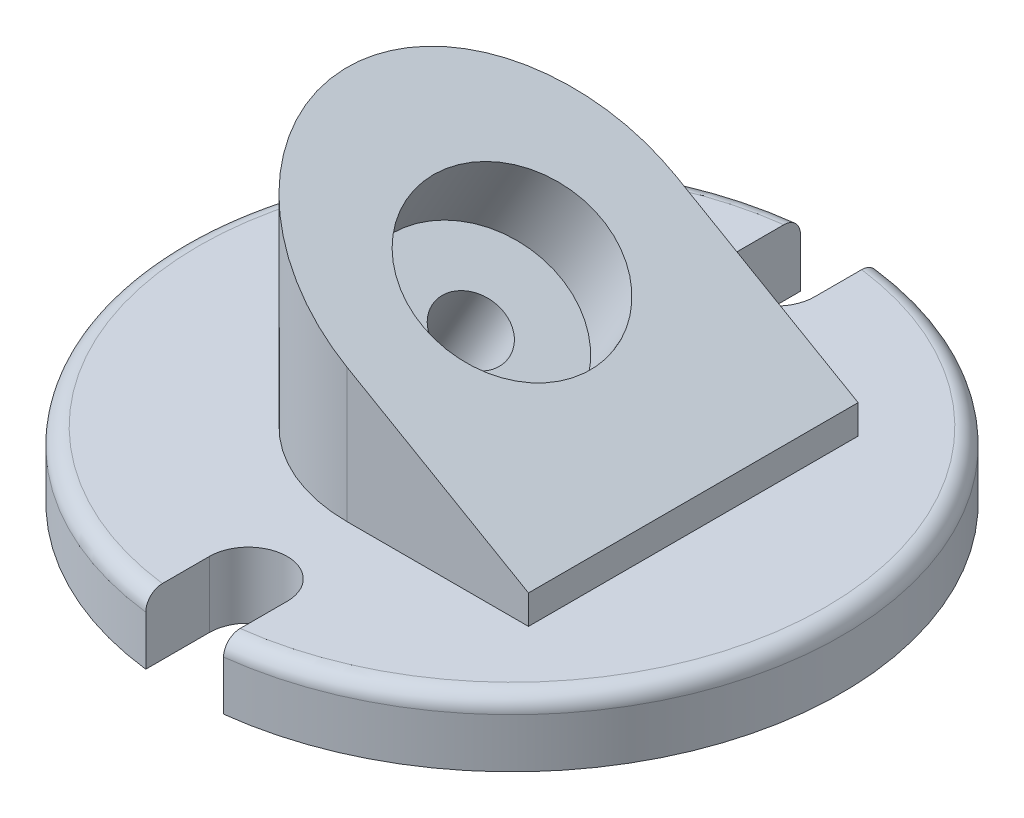
ISO-10303-21;
HEADER;
FILE_DESCRIPTION(('STEP AP214'),'2;1');
FILE_NAME('part.step','',(''),(''),'','','');
FILE_SCHEMA(('AUTOMOTIVE_DESIGN { 1 0 10303 214 1 1 1 1 }'));
ENDSEC;
DATA;
#1=APPLICATION_CONTEXT('core data for automotive mechanical design processes');
#2=APPLICATION_PROTOCOL_DEFINITION('international standard','automotive_design',2000,#1);
#3=PRODUCT_CONTEXT('',#1,'mechanical');
#4=PRODUCT('Part','Part','',(#3));
#5=PRODUCT_RELATED_PRODUCT_CATEGORY('part','',(#4));
#6=PRODUCT_DEFINITION_FORMATION('','',#4);
#7=PRODUCT_DEFINITION_CONTEXT('part definition',#1,'design');
#8=PRODUCT_DEFINITION('design','',#6,#7);
#9=PRODUCT_DEFINITION_SHAPE('','',#8);
#10=(LENGTH_UNIT() NAMED_UNIT(*) SI_UNIT(.MILLI.,.METRE.));
#11=(NAMED_UNIT(*) PLANE_ANGLE_UNIT() SI_UNIT($,.RADIAN.));
#12=(NAMED_UNIT(*) SI_UNIT($,.STERADIAN.) SOLID_ANGLE_UNIT());
#13=UNCERTAINTY_MEASURE_WITH_UNIT(LENGTH_MEASURE(1.E-05),#10,'distance_accuracy_value','');
#14=(GEOMETRIC_REPRESENTATION_CONTEXT(3) GLOBAL_UNCERTAINTY_ASSIGNED_CONTEXT((#13)) GLOBAL_UNIT_ASSIGNED_CONTEXT((#10,
#11,#12)) REPRESENTATION_CONTEXT('',''));
#15=CARTESIAN_POINT('',(0.,0.,0.));
#16=DIRECTION('',(0.,0.,1.));
#17=DIRECTION('',(1.,0.,0.));
#18=AXIS2_PLACEMENT_3D('',#15,#16,#17);
#19=CARTESIAN_POINT('',(16.650186292205,28.8389686135858,0.));
#20=DIRECTION('',(0.500000000000001,0.866025403784438,0.));
#21=DIRECTION('',(-0.866025403784438,0.500000000000001,0.));
#22=AXIS2_PLACEMENT_3D('',#19,#20,#21);
#23=PLANE('',#22);
#24=DIRECTION('',(0.,0.,-1.));
#25=VECTOR('',#24,1.);
#26=CARTESIAN_POINT('',(34.925,18.288,31.75));
#27=LINE('',#26,#25);
#28=CARTESIAN_POINT('',(34.925,18.288,31.75));
#29=VERTEX_POINT('',#28);
#30=CARTESIAN_POINT('',(34.925,18.288,-31.75));
#31=VERTEX_POINT('',#30);
#32=EDGE_CURVE('E170',#29,#31,#27,.T.);
#33=ORIENTED_EDGE('',*,*,#32,.T.);
#34=DIRECTION('',(-0.866025403784438,0.500000000000001,0.));
#35=VECTOR('',#34,1.);
#36=CARTESIAN_POINT('',(-16.3629472633631,47.8991101586861,-31.75));
#37=LINE('',#36,#35);
#38=CARTESIAN_POINT('',(0.,38.4519581514477,-31.75));
#39=VERTEX_POINT('',#38);
#40=EDGE_CURVE('E150',#31,#39,#37,.T.);
#41=ORIENTED_EDGE('',*,*,#40,.T.);
#42=CARTESIAN_POINT('',(0.,38.4519581514477,0.));
#43=DIRECTION('',(0.500000000000001,0.866025403784438,0.));
#44=DIRECTION('',(0.866025403784438,-0.500000000000001,0.));
#45=AXIS2_PLACEMENT_3D('',#42,#43,#44);
#46=ELLIPSE('',#45,36.6617420935412,31.75);
#47=CARTESIAN_POINT('',(0.,38.4519581514477,31.75));
#48=VERTEX_POINT('',#47);
#49=EDGE_CURVE('E160',#39,#48,#46,.T.);
#50=ORIENTED_EDGE('',*,*,#49,.T.);
#51=DIRECTION('',(0.866025403784438,-0.500000000000001,0.));
#52=VECTOR('',#51,1.);
#53=CARTESIAN_POINT('',(-42.5566972633631,63.0220787722719,31.75));
#54=LINE('',#53,#52);
#55=EDGE_CURVE('E166',#48,#29,#54,.T.);
#56=ORIENTED_EDGE('',*,*,#55,.T.);
#57=EDGE_LOOP('',(#33,#41,#50,#56));
#58=FACE_BOUND('',#57,.T.);
#59=CARTESIAN_POINT('',(0.,38.4519581514478,0.));
#60=DIRECTION('',(0.500000000000001,0.866025403784438,0.));
#61=DIRECTION('',(-0.866025403784438,0.500000000000001,0.));
#62=AXIS2_PLACEMENT_3D('',#59,#60,#61);
#63=CIRCLE('',#62,17.4625);
#64=CARTESIAN_POINT('',(-15.1229686135857,47.1832081514478,0.));
#65=VERTEX_POINT('',#64);
#66=EDGE_CURVE('E384',#65,#65,#63,.T.);
#67=ORIENTED_EDGE('',*,*,#66,.F.);
#68=EDGE_LOOP('',(#67));
#69=FACE_BOUND('',#68,.T.);
#70=ADVANCED_FACE('F44',(#58,#69),#23,.T.);
#71=CARTESIAN_POINT('',(0.,0.,0.));
#72=DIRECTION('',(0.,1.,0.));
#73=DIRECTION('',(0.,0.,1.));
#74=AXIS2_PLACEMENT_3D('',#71,#72,#73);
#75=PLANE('',#74);
#76=CARTESIAN_POINT('',(0.,0.,0.));
#77=DIRECTION('',(0.,1.,0.));
#78=DIRECTION('',(0.,0.,1.));
#79=AXIS2_PLACEMENT_3D('',#76,#77,#78);
#80=CIRCLE('',#79,63.5);
#81=CARTESIAN_POINT('',(7.493,0.,63.0563632871418));
#82=VERTEX_POINT('',#81);
#83=CARTESIAN_POINT('',(7.493,0.,-63.0563632871418));
#84=VERTEX_POINT('',#83);
#85=EDGE_CURVE('E190',#82,#84,#80,.T.);
#86=ORIENTED_EDGE('',*,*,#85,.F.);
#87=DIRECTION('',(0.,0.,-1.));
#88=VECTOR('',#87,1.);
#89=CARTESIAN_POINT('',(7.493,0.,63.0563632871418));
#90=LINE('',#89,#88);
#91=CARTESIAN_POINT('',(7.493,0.,50.8));
#92=VERTEX_POINT('',#91);
#93=EDGE_CURVE('E194',#82,#92,#90,.T.);
#94=ORIENTED_EDGE('',*,*,#93,.T.);
#95=CARTESIAN_POINT('',(0.,0.,50.8));
#96=DIRECTION('',(0.,1.,0.));
#97=DIRECTION('',(0.,0.,1.));
#98=AXIS2_PLACEMENT_3D('',#95,#96,#97);
#99=CIRCLE('',#98,7.493);
#100=CARTESIAN_POINT('',(-7.493,0.,50.8));
#101=VERTEX_POINT('',#100);
#102=EDGE_CURVE('E223',#92,#101,#99,.T.);
#103=ORIENTED_EDGE('',*,*,#102,.T.);
#104=DIRECTION('',(0.,0.,-1.));
#105=VECTOR('',#104,1.);
#106=CARTESIAN_POINT('',(-7.493,0.,63.0563632871418));
#107=LINE('',#106,#105);
#108=CARTESIAN_POINT('',(-7.49300000000001,0.,63.0563632871418));
#109=VERTEX_POINT('',#108);
#110=EDGE_CURVE('E220',#109,#101,#107,.T.);
#111=ORIENTED_EDGE('',*,*,#110,.F.);
#112=CARTESIAN_POINT('',(0.,0.,0.));
#113=DIRECTION('',(0.,1.,0.));
#114=DIRECTION('',(0.,0.,1.));
#115=AXIS2_PLACEMENT_3D('',#112,#113,#114);
#116=CIRCLE('',#115,63.5);
#117=CARTESIAN_POINT('',(-7.493,0.,-63.0563632871418));
#118=VERTEX_POINT('',#117);
#119=EDGE_CURVE('E217',#118,#109,#116,.T.);
#120=ORIENTED_EDGE('',*,*,#119,.F.);
#121=DIRECTION('',(0.,0.,1.));
#122=VECTOR('',#121,1.);
#123=CARTESIAN_POINT('',(-7.493,0.,-63.0563632871418));
#124=LINE('',#123,#122);
#125=CARTESIAN_POINT('',(-7.493,0.,-50.8));
#126=VERTEX_POINT('',#125);
#127=EDGE_CURVE('E214',#118,#126,#124,.T.);
#128=ORIENTED_EDGE('',*,*,#127,.T.);
#129=CARTESIAN_POINT('',(0.,0.,-50.8));
#130=DIRECTION('',(0.,-1.,0.));
#131=DIRECTION('',(0.,0.,-1.));
#132=AXIS2_PLACEMENT_3D('',#129,#130,#131);
#133=CIRCLE('',#132,7.493);
#134=CARTESIAN_POINT('',(7.493,0.,-50.8));
#135=VERTEX_POINT('',#134);
#136=EDGE_CURVE('E211',#135,#126,#133,.T.);
#137=ORIENTED_EDGE('',*,*,#136,.F.);
#138=DIRECTION('',(0.,0.,1.));
#139=VECTOR('',#138,1.);
#140=CARTESIAN_POINT('',(7.493,0.,-63.0563632871418));
#141=LINE('',#140,#139);
#142=EDGE_CURVE('E209',#84,#135,#141,.T.);
#143=ORIENTED_EDGE('',*,*,#142,.F.);
#144=EDGE_LOOP('',(#86,#94,#103,#111,#120,#128,#137,#143));
#145=FACE_BOUND('',#144,.T.);
#146=CARTESIAN_POINT('',(-22.2002483896067,0.,0.));
#147=DIRECTION('',(0.,1.,0.));
#148=DIRECTION('',(1.,0.,0.));
#149=AXIS2_PLACEMENT_3D('',#146,#147,#148);
#150=ELLIPSE('',#149,7.33234841870825,6.34999999999999);
#151=CARTESIAN_POINT('',(-14.8678999708984,0.,0.));
#152=VERTEX_POINT('',#151);
#153=EDGE_CURVE('E49',#152,#152,#150,.F.);
#154=ORIENTED_EDGE('',*,*,#153,.F.);
#155=EDGE_LOOP('',(#154));
#156=FACE_BOUND('',#155,.T.);
#157=ADVANCED_FACE('F301',(#145,#156),#75,.F.);
#158=CARTESIAN_POINT('',(0.,12.7,0.));
#159=DIRECTION('',(0.,1.,0.));
#160=DIRECTION('',(0.,0.,1.));
#161=AXIS2_PLACEMENT_3D('',#158,#159,#160);
#162=PLANE('',#161);
#163=DIRECTION('',(0.,0.,1.));
#164=VECTOR('',#163,1.);
#165=CARTESIAN_POINT('',(-7.493,12.7,-63.0563632871418));
#166=LINE('',#165,#164);
#167=CARTESIAN_POINT('',(-7.493,12.7,-59.8578363792077));
#168=VERTEX_POINT('',#167);
#169=CARTESIAN_POINT('',(-7.493,12.7,-50.8));
#170=VERTEX_POINT('',#169);
#171=EDGE_CURVE('E197',#168,#170,#166,.T.);
#172=ORIENTED_EDGE('',*,*,#171,.F.);
#173=CARTESIAN_POINT('',(0.,12.7,0.));
#174=DIRECTION('',(0.,1.,0.));
#175=DIRECTION('',(0.,0.,1.));
#176=AXIS2_PLACEMENT_3D('',#173,#174,#175);
#177=CIRCLE('',#176,60.325);
#178=CARTESIAN_POINT('',(-7.493,12.7,59.8578363792077));
#179=VERTEX_POINT('',#178);
#180=EDGE_CURVE('E247',#168,#179,#177,.T.);
#181=ORIENTED_EDGE('',*,*,#180,.T.);
#182=DIRECTION('',(0.,0.,-1.));
#183=VECTOR('',#182,1.);
#184=CARTESIAN_POINT('',(-7.493,12.7,63.0563632871418));
#185=LINE('',#184,#183);
#186=CARTESIAN_POINT('',(-7.493,12.7,50.8));
#187=VERTEX_POINT('',#186);
#188=EDGE_CURVE('E199',#179,#187,#185,.T.);
#189=ORIENTED_EDGE('',*,*,#188,.T.);
#190=CARTESIAN_POINT('',(0.,12.7,50.8));
#191=DIRECTION('',(0.,1.,0.));
#192=DIRECTION('',(0.,0.,1.));
#193=AXIS2_PLACEMENT_3D('',#190,#191,#192);
#194=CIRCLE('',#193,7.493);
#195=CARTESIAN_POINT('',(7.493,12.7,50.8));
#196=VERTEX_POINT('',#195);
#197=EDGE_CURVE('E201',#196,#187,#194,.T.);
#198=ORIENTED_EDGE('',*,*,#197,.F.);
#199=DIRECTION('',(0.,0.,-1.));
#200=VECTOR('',#199,1.);
#201=CARTESIAN_POINT('',(7.493,12.7,63.0563632871418));
#202=LINE('',#201,#200);
#203=CARTESIAN_POINT('',(7.493,12.7,59.8578363792077));
#204=VERTEX_POINT('',#203);
#205=EDGE_CURVE('E204',#204,#196,#202,.T.);
#206=ORIENTED_EDGE('',*,*,#205,.F.);
#207=CARTESIAN_POINT('',(0.,12.7,0.));
#208=DIRECTION('',(0.,1.,0.));
#209=DIRECTION('',(0.,0.,1.));
#210=AXIS2_PLACEMENT_3D('',#207,#208,#209);
#211=CIRCLE('',#210,60.325);
#212=CARTESIAN_POINT('',(7.493,12.7,-59.8578363792077));
#213=VERTEX_POINT('',#212);
#214=EDGE_CURVE('E244',#204,#213,#211,.T.);
#215=ORIENTED_EDGE('',*,*,#214,.T.);
#216=DIRECTION('',(0.,0.,1.));
#217=VECTOR('',#216,1.);
#218=CARTESIAN_POINT('',(7.493,12.7,-63.0563632871418));
#219=LINE('',#218,#217);
#220=CARTESIAN_POINT('',(7.493,12.7,-50.8));
#221=VERTEX_POINT('',#220);
#222=EDGE_CURVE('E191',#213,#221,#219,.T.);
#223=ORIENTED_EDGE('',*,*,#222,.T.);
#224=CARTESIAN_POINT('',(0.,12.7,-50.8));
#225=DIRECTION('',(0.,-1.,0.));
#226=DIRECTION('',(0.,0.,-1.));
#227=AXIS2_PLACEMENT_3D('',#224,#225,#226);
#228=CIRCLE('',#227,7.493);
#229=EDGE_CURVE('E193',#221,#170,#228,.T.);
#230=ORIENTED_EDGE('',*,*,#229,.T.);
#231=EDGE_LOOP('',(#172,#181,#189,#198,#206,#215,#223,#230));
#232=FACE_BOUND('',#231,.T.);
#233=CARTESIAN_POINT('',(0.,12.7,0.));
#234=DIRECTION('',(0.,1.,0.));
#235=DIRECTION('',(0.,0.,1.));
#236=AXIS2_PLACEMENT_3D('',#233,#234,#235);
#237=CIRCLE('',#236,31.75);
#238=CARTESIAN_POINT('',(0.,12.7,31.75));
#239=VERTEX_POINT('',#238);
#240=CARTESIAN_POINT('',(0.,12.7,-31.75));
#241=VERTEX_POINT('',#240);
#242=EDGE_CURVE('E187',#239,#241,#237,.F.);
#243=ORIENTED_EDGE('',*,*,#242,.T.);
#244=DIRECTION('',(1.,0.,0.));
#245=VECTOR('',#244,1.);
#246=CARTESIAN_POINT('',(0.,12.7,-31.75));
#247=LINE('',#246,#245);
#248=CARTESIAN_POINT('',(34.925,12.7,-31.75));
#249=VERTEX_POINT('',#248);
#250=EDGE_CURVE('E153',#241,#249,#247,.T.);
#251=ORIENTED_EDGE('',*,*,#250,.T.);
#252=DIRECTION('',(0.,0.,1.));
#253=VECTOR('',#252,1.);
#254=CARTESIAN_POINT('',(34.925,12.7,0.));
#255=LINE('',#254,#253);
#256=CARTESIAN_POINT('',(34.925,12.7,31.75));
#257=VERTEX_POINT('',#256);
#258=EDGE_CURVE('E156',#249,#257,#255,.T.);
#259=ORIENTED_EDGE('',*,*,#258,.T.);
#260=DIRECTION('',(1.,0.,0.));
#261=VECTOR('',#260,1.);
#262=CARTESIAN_POINT('',(0.,12.7,31.75));
#263=LINE('',#262,#261);
#264=EDGE_CURVE('E184',#239,#257,#263,.T.);
#265=ORIENTED_EDGE('',*,*,#264,.F.);
#266=EDGE_LOOP('',(#243,#251,#259,#265));
#267=FACE_BOUND('',#266,.T.);
#268=ADVANCED_FACE('F297',(#232,#267),#162,.T.);
#269=CARTESIAN_POINT('',(0.,12.7,0.));
#270=DIRECTION('',(0.,-1.,0.));
#271=DIRECTION('',(0.,0.,-1.));
#272=AXIS2_PLACEMENT_3D('',#269,#270,#271);
#273=CYLINDRICAL_SURFACE('',#272,63.5);
#274=DIRECTION('',(0.,-1.,0.));
#275=VECTOR('',#274,1.);
#276=CARTESIAN_POINT('',(7.493,12.7,-63.0563632871418));
#277=LINE('',#276,#275);
#278=CARTESIAN_POINT('',(7.493,9.525,-63.0563632871418));
#279=VERTEX_POINT('',#278);
#280=EDGE_CURVE('E242',#279,#84,#277,.T.);
#281=ORIENTED_EDGE('',*,*,#280,.F.);
#282=CARTESIAN_POINT('',(0.,9.525,0.));
#283=DIRECTION('',(0.,1.,0.));
#284=DIRECTION('',(0.,0.,1.));
#285=AXIS2_PLACEMENT_3D('',#282,#283,#284);
#286=CIRCLE('',#285,63.5);
#287=CARTESIAN_POINT('',(7.493,9.525,63.0563632871418));
#288=VERTEX_POINT('',#287);
#289=EDGE_CURVE('E54',#279,#288,#286,.F.);
#290=ORIENTED_EDGE('',*,*,#289,.T.);
#291=DIRECTION('',(0.,-1.,0.));
#292=VECTOR('',#291,1.);
#293=CARTESIAN_POINT('',(7.493,12.7,63.0563632871418));
#294=LINE('',#293,#292);
#295=EDGE_CURVE('E206',#288,#82,#294,.T.);
#296=ORIENTED_EDGE('',*,*,#295,.T.);
#297=ORIENTED_EDGE('',*,*,#85,.T.);
#298=EDGE_LOOP('',(#281,#290,#296,#297));
#299=FACE_BOUND('',#298,.T.);
#300=ADVANCED_FACE('F295',(#299),#273,.T.);
#301=CARTESIAN_POINT('',(7.493,12.7,-63.0563632871418));
#302=DIRECTION('',(1.,0.,0.));
#303=DIRECTION('',(0.,0.,-1.));
#304=AXIS2_PLACEMENT_3D('',#301,#302,#303);
#305=PLANE('',#304);
#306=ORIENTED_EDGE('',*,*,#222,.F.);
#307=CARTESIAN_POINT('',(7.493,12.7,-59.8578363792077));
#308=CARTESIAN_POINT('',(7.493,12.7000081902855,-59.9483026428567));
#309=CARTESIAN_POINT('',(7.493,12.6961931349332,-60.0387651776464));
#310=CARTESIAN_POINT('',(7.493,12.6809783241897,-60.2190476056248));
#311=CARTESIAN_POINT('',(7.493,12.6695787901576,-60.3088675174917));
#312=CARTESIAN_POINT('',(7.493,12.6392647366687,-60.4871882216858));
#313=CARTESIAN_POINT('',(7.493,12.6203541511115,-60.5756896794166));
#314=CARTESIAN_POINT('',(7.493,12.5751639314986,-60.7507637826237));
#315=CARTESIAN_POINT('',(7.493,12.5488844165907,-60.8373364592619));
#316=CARTESIAN_POINT('',(7.493,12.4591855977443,-61.0933396877261));
#317=CARTESIAN_POINT('',(7.493,12.3848965379726,-61.2591109838345));
#318=CARTESIAN_POINT('',(7.493,12.2094914486922,-61.5756326115585));
#319=CARTESIAN_POINT('',(7.493,12.1083820247299,-61.7263866291983));
#320=CARTESIAN_POINT('',(7.493,11.8825416779224,-62.0081145230092));
#321=CARTESIAN_POINT('',(7.493,11.7579018000514,-62.1391612517838));
#322=CARTESIAN_POINT('',(7.493,11.488221634608,-62.3783095990498));
#323=CARTESIAN_POINT('',(7.493,11.3431776253743,-62.4864070226015));
#324=CARTESIAN_POINT('',(7.493,11.0379139238402,-62.6757669212141));
#325=CARTESIAN_POINT('',(7.493,10.8778049240722,-62.7572080448967));
#326=CARTESIAN_POINT('',(7.493,10.5461649667633,-62.8918143418568));
#327=CARTESIAN_POINT('',(7.493,10.374641952799,-62.944998953379));
#328=CARTESIAN_POINT('',(7.493,10.0891240921032,-63.0075680968185));
#329=CARTESIAN_POINT('',(7.493,9.97700181620676,-63.0258555438743));
#330=CARTESIAN_POINT('',(7.493,9.75160285514698,-63.0502508081899));
#331=CARTESIAN_POINT('',(7.493,9.63832805276945,-63.0563760271335));
#332=CARTESIAN_POINT('',(7.493,9.525,-63.0563632871418));
#333=B_SPLINE_CURVE_WITH_KNOTS('',3,(#307,#308,#309,#310,#311,#312,#313,#314,#315,#316,#317,
#318,#319,#320,#321,#322,#323,#324,#325,#326,#327,#328,#329,#330,#331,#332),.UNSPECIFIED.,.F.,
.F.,(4,2,2,2,2,2,2,2,2,2,2,2,4),(0.,0.271311542078362,0.542615166062087,0.813776882243669,
1.08493421428346,1.62708196121886,2.16909630719387,2.70905492647848,3.24911216083515,
3.78547210279738,4.32146259223689,4.66166462942819,5.00137955468052),.UNSPECIFIED.);
#334=EDGE_CURVE('E68',#213,#279,#333,.T.);
#335=ORIENTED_EDGE('',*,*,#334,.T.);
#336=ORIENTED_EDGE('',*,*,#280,.T.);
#337=ORIENTED_EDGE('',*,*,#142,.T.);
#338=DIRECTION('',(0.,-1.,0.));
#339=VECTOR('',#338,1.);
#340=CARTESIAN_POINT('',(7.493,12.7,-50.8));
#341=LINE('',#340,#339);
#342=EDGE_CURVE('E239',#221,#135,#341,.T.);
#343=ORIENTED_EDGE('',*,*,#342,.F.);
#344=EDGE_LOOP('',(#306,#335,#336,#337,#343));
#345=FACE_BOUND('',#344,.T.);
#346=ADVANCED_FACE('F292',(#345),#305,.F.);
#347=CARTESIAN_POINT('',(0.,12.7,-50.8));
#348=DIRECTION('',(0.,-1.,0.));
#349=DIRECTION('',(0.,0.,-1.));
#350=AXIS2_PLACEMENT_3D('',#347,#348,#349);
#351=CYLINDRICAL_SURFACE('',#350,7.493);
#352=ORIENTED_EDGE('',*,*,#136,.T.);
#353=DIRECTION('',(0.,-1.,0.));
#354=VECTOR('',#353,1.);
#355=CARTESIAN_POINT('',(-7.493,12.7,-50.8));
#356=LINE('',#355,#354);
#357=EDGE_CURVE('E237',#170,#126,#356,.T.);
#358=ORIENTED_EDGE('',*,*,#357,.F.);
#359=ORIENTED_EDGE('',*,*,#229,.F.);
#360=ORIENTED_EDGE('',*,*,#342,.T.);
#361=EDGE_LOOP('',(#352,#358,#359,#360));
#362=FACE_BOUND('',#361,.T.);
#363=ADVANCED_FACE('F278',(#362),#351,.F.);
#364=CARTESIAN_POINT('',(-7.493,12.7,-63.0563632871418));
#365=DIRECTION('',(1.,0.,0.));
#366=DIRECTION('',(0.,0.,-1.));
#367=AXIS2_PLACEMENT_3D('',#364,#365,#366);
#368=PLANE('',#367);
#369=DIRECTION('',(0.,-1.,0.));
#370=VECTOR('',#369,1.);
#371=CARTESIAN_POINT('',(-7.493,12.7,-63.0563632871418));
#372=LINE('',#371,#370);
#373=CARTESIAN_POINT('',(-7.493,9.525,-63.0563632871418));
#374=VERTEX_POINT('',#373);
#375=EDGE_CURVE('E235',#374,#118,#372,.T.);
#376=ORIENTED_EDGE('',*,*,#375,.F.);
#377=CARTESIAN_POINT('',(-7.493,9.525,-63.0563632871418));
#378=CARTESIAN_POINT('',(-7.493,9.61384201257575,-63.0563722172818));
#379=CARTESIAN_POINT('',(-7.493,9.70267978637746,-63.0526081719285));
#380=CARTESIAN_POINT('',(-7.493,9.87971636707317,-63.0376031574968));
#381=CARTESIAN_POINT('',(-7.493,9.96791521280003,-63.0263626467444));
#382=CARTESIAN_POINT('',(-7.493,10.1429716509862,-62.99648785064));
#383=CARTESIAN_POINT('',(-7.493,10.2298304333518,-62.9778605699293));
#384=CARTESIAN_POINT('',(-7.493,10.4016482407808,-62.9333686505377));
#385=CARTESIAN_POINT('',(-7.493,10.4866072842229,-62.9075040819054));
#386=CARTESIAN_POINT('',(-7.493,10.737805362225,-62.8192774903242));
#387=CARTESIAN_POINT('',(-7.493,10.9004485042657,-62.7462683013381));
#388=CARTESIAN_POINT('',(-7.493,11.2111052755814,-62.574105397956));
#389=CARTESIAN_POINT('',(-7.493,11.3591206948893,-62.4749548880024));
#390=CARTESIAN_POINT('',(-7.493,11.6369705263639,-62.2530149906903));
#391=CARTESIAN_POINT('',(-7.493,11.7667495775717,-62.1301562006409));
#392=CARTESIAN_POINT('',(-7.493,12.0040225037668,-61.8644992848078));
#393=CARTESIAN_POINT('',(-7.493,12.1115117957162,-61.7216970685007));
#394=CARTESIAN_POINT('',(-7.493,12.3019170469733,-61.4192026780758));
#395=CARTESIAN_POINT('',(-7.493,12.384660011677,-61.2594017242321));
#396=CARTESIAN_POINT('',(-7.493,12.5223130585419,-60.928267450133));
#397=CARTESIAN_POINT('',(-7.493,12.577236352028,-60.7569396477533));
#398=CARTESIAN_POINT('',(-7.493,12.6449371333594,-60.4635572298952));
#399=CARTESIAN_POINT('',(-7.493,12.6655743684647,-60.3432553931405));
#400=CARTESIAN_POINT('',(-7.493,12.6931046021749,-60.101263386127));
#401=CARTESIAN_POINT('',(-7.493,12.7000171668983,-59.9795754413766));
#402=CARTESIAN_POINT('',(-7.493,12.7,-59.8578363792077));
#403=B_SPLINE_CURVE_WITH_KNOTS('',3,(#377,#378,#379,#380,#381,#382,#383,#384,#385,#386,#387,
#388,#389,#390,#391,#392,#393,#394,#395,#396,#397,#398,#399,#400,#401,#402),.UNSPECIFIED.,.F.,
.F.,(4,2,2,2,2,2,2,2,2,2,2,2,4),(0.,0.266438735370765,0.532861138888009,0.799031504258994,
1.06519929349808,1.59728492976393,2.12930537247425,2.66290752749052,3.19661928886874,
3.73397926266116,4.27108380896084,4.63652657888032,5.00144799235249),.UNSPECIFIED.);
#404=EDGE_CURVE('E281',#374,#168,#403,.T.);
#405=ORIENTED_EDGE('',*,*,#404,.T.);
#406=ORIENTED_EDGE('',*,*,#171,.T.);
#407=ORIENTED_EDGE('',*,*,#357,.T.);
#408=ORIENTED_EDGE('',*,*,#127,.F.);
#409=EDGE_LOOP('',(#376,#405,#406,#407,#408));
#410=FACE_BOUND('',#409,.T.);
#411=ADVANCED_FACE('F273',(#410),#368,.T.);
#412=CARTESIAN_POINT('',(0.,12.7,0.));
#413=DIRECTION('',(0.,-1.,0.));
#414=DIRECTION('',(0.,0.,-1.));
#415=AXIS2_PLACEMENT_3D('',#412,#413,#414);
#416=CYLINDRICAL_SURFACE('',#415,63.5);
#417=DIRECTION('',(0.,-1.,0.));
#418=VECTOR('',#417,1.);
#419=CARTESIAN_POINT('',(-7.49300000000001,12.7,63.0563632871418));
#420=LINE('',#419,#418);
#421=CARTESIAN_POINT('',(-7.49300000000001,9.525,63.0563632871418));
#422=VERTEX_POINT('',#421);
#423=EDGE_CURVE('E233',#422,#109,#420,.T.);
#424=ORIENTED_EDGE('',*,*,#423,.F.);
#425=CARTESIAN_POINT('',(0.,9.525,0.));
#426=DIRECTION('',(0.,1.,0.));
#427=DIRECTION('',(0.,0.,1.));
#428=AXIS2_PLACEMENT_3D('',#425,#426,#427);
#429=CIRCLE('',#428,63.5);
#430=EDGE_CURVE('E257',#422,#374,#429,.F.);
#431=ORIENTED_EDGE('',*,*,#430,.T.);
#432=ORIENTED_EDGE('',*,*,#375,.T.);
#433=ORIENTED_EDGE('',*,*,#119,.T.);
#434=EDGE_LOOP('',(#424,#431,#432,#433));
#435=FACE_BOUND('',#434,.T.);
#436=ADVANCED_FACE('F268',(#435),#416,.T.);
#437=CARTESIAN_POINT('',(-7.493,12.7,63.0563632871418));
#438=DIRECTION('',(-1.,0.,0.));
#439=DIRECTION('',(0.,0.,1.));
#440=AXIS2_PLACEMENT_3D('',#437,#438,#439);
#441=PLANE('',#440);
#442=ORIENTED_EDGE('',*,*,#188,.F.);
#443=CARTESIAN_POINT('',(-7.493,12.7,59.8578363792077));
#444=CARTESIAN_POINT('',(-7.493,12.7000081902855,59.9483026428567));
#445=CARTESIAN_POINT('',(-7.493,12.6961931349332,60.0387651776464));
#446=CARTESIAN_POINT('',(-7.493,12.6809783241897,60.2190476056248));
#447=CARTESIAN_POINT('',(-7.493,12.6695787901576,60.3088675174916));
#448=CARTESIAN_POINT('',(-7.493,12.6392647366687,60.4871882216858));
#449=CARTESIAN_POINT('',(-7.493,12.6203541511115,60.5756896794166));
#450=CARTESIAN_POINT('',(-7.493,12.5751639314986,60.7507637826237));
#451=CARTESIAN_POINT('',(-7.493,12.5488844165907,60.8373364592619));
#452=CARTESIAN_POINT('',(-7.493,12.4591855977443,61.0933396877261));
#453=CARTESIAN_POINT('',(-7.493,12.3848965379726,61.2591109838345));
#454=CARTESIAN_POINT('',(-7.493,12.2094914486922,61.5756326115585));
#455=CARTESIAN_POINT('',(-7.493,12.1083820247299,61.7263866291982));
#456=CARTESIAN_POINT('',(-7.493,11.8825416779224,62.0081145230092));
#457=CARTESIAN_POINT('',(-7.493,11.7579018000514,62.1391612517838));
#458=CARTESIAN_POINT('',(-7.493,11.488221634608,62.3783095990498));
#459=CARTESIAN_POINT('',(-7.493,11.3431776253743,62.4864070226015));
#460=CARTESIAN_POINT('',(-7.493,11.0379139238402,62.6757669212141));
#461=CARTESIAN_POINT('',(-7.493,10.8778049240722,62.7572080448967));
#462=CARTESIAN_POINT('',(-7.493,10.5461649667633,62.8918143418568));
#463=CARTESIAN_POINT('',(-7.493,10.374641952799,62.9449989533789));
#464=CARTESIAN_POINT('',(-7.493,10.0891240921032,63.0075680968185));
#465=CARTESIAN_POINT('',(-7.493,9.97700181620676,63.0258555438743));
#466=CARTESIAN_POINT('',(-7.493,9.75160285514698,63.0502508081899));
#467=CARTESIAN_POINT('',(-7.493,9.63832805276945,63.0563760271335));
#468=CARTESIAN_POINT('',(-7.493,9.525,63.0563632871418));
#469=B_SPLINE_CURVE_WITH_KNOTS('',3,(#443,#444,#445,#446,#447,#448,#449,#450,#451,#452,#453,
#454,#455,#456,#457,#458,#459,#460,#461,#462,#463,#464,#465,#466,#467,#468),.UNSPECIFIED.,.F.,
.F.,(4,2,2,2,2,2,2,2,2,2,2,2,4),(0.,0.271311542078362,0.542615166062087,0.813776882243669,
1.08493421428346,1.62708196121886,2.16909630719387,2.70905492647848,3.24911216083515,
3.78547210279737,4.3214625922369,4.6616646294282,5.00137955468052),.UNSPECIFIED.);
#470=EDGE_CURVE('E250',#179,#422,#469,.T.);
#471=ORIENTED_EDGE('',*,*,#470,.T.);
#472=ORIENTED_EDGE('',*,*,#423,.T.);
#473=ORIENTED_EDGE('',*,*,#110,.T.);
#474=DIRECTION('',(0.,-1.,0.));
#475=VECTOR('',#474,1.);
#476=CARTESIAN_POINT('',(-7.493,12.7,50.8));
#477=LINE('',#476,#475);
#478=EDGE_CURVE('E231',#187,#101,#477,.T.);
#479=ORIENTED_EDGE('',*,*,#478,.F.);
#480=EDGE_LOOP('',(#442,#471,#472,#473,#479));
#481=FACE_BOUND('',#480,.T.);
#482=ADVANCED_FACE('F262',(#481),#441,.F.);
#483=CARTESIAN_POINT('',(0.,12.7,50.8));
#484=DIRECTION('',(0.,-1.,0.));
#485=DIRECTION('',(0.,0.,-1.));
#486=AXIS2_PLACEMENT_3D('',#483,#484,#485);
#487=CYLINDRICAL_SURFACE('',#486,7.493);
#488=ORIENTED_EDGE('',*,*,#102,.F.);
#489=DIRECTION('',(0.,-1.,0.));
#490=VECTOR('',#489,1.);
#491=CARTESIAN_POINT('',(7.493,12.7,50.8));
#492=LINE('',#491,#490);
#493=EDGE_CURVE('E229',#196,#92,#492,.T.);
#494=ORIENTED_EDGE('',*,*,#493,.F.);
#495=ORIENTED_EDGE('',*,*,#197,.T.);
#496=ORIENTED_EDGE('',*,*,#478,.T.);
#497=EDGE_LOOP('',(#488,#494,#495,#496));
#498=FACE_BOUND('',#497,.T.);
#499=ADVANCED_FACE('F267',(#498),#487,.F.);
#500=CARTESIAN_POINT('',(7.493,12.7,63.0563632871418));
#501=DIRECTION('',(-1.,0.,0.));
#502=DIRECTION('',(0.,0.,1.));
#503=AXIS2_PLACEMENT_3D('',#500,#501,#502);
#504=PLANE('',#503);
#505=ORIENTED_EDGE('',*,*,#295,.F.);
#506=CARTESIAN_POINT('',(7.493,9.525,63.0563632871418));
#507=CARTESIAN_POINT('',(7.493,9.61384201257576,63.0563722172818));
#508=CARTESIAN_POINT('',(7.493,9.70267978637746,63.0526081719285));
#509=CARTESIAN_POINT('',(7.493,9.87971636707317,63.0376031574969));
#510=CARTESIAN_POINT('',(7.493,9.96791521280004,63.0263626467444));
#511=CARTESIAN_POINT('',(7.493,10.1429716509862,62.99648785064));
#512=CARTESIAN_POINT('',(7.493,10.2298304333518,62.9778605699293));
#513=CARTESIAN_POINT('',(7.493,10.4016482407808,62.9333686505377));
#514=CARTESIAN_POINT('',(7.493,10.4866072842229,62.9075040819054));
#515=CARTESIAN_POINT('',(7.493,10.737805362225,62.8192774903242));
#516=CARTESIAN_POINT('',(7.493,10.9004485042657,62.7462683013381));
#517=CARTESIAN_POINT('',(7.493,11.2111052755814,62.574105397956));
#518=CARTESIAN_POINT('',(7.493,11.3591206948893,62.4749548880024));
#519=CARTESIAN_POINT('',(7.493,11.6369705263639,62.2530149906903));
#520=CARTESIAN_POINT('',(7.493,11.7667495775717,62.1301562006409));
#521=CARTESIAN_POINT('',(7.493,12.0040225037668,61.8644992848078));
#522=CARTESIAN_POINT('',(7.493,12.1115117957162,61.7216970685007));
#523=CARTESIAN_POINT('',(7.493,12.3019170469733,61.4192026780758));
#524=CARTESIAN_POINT('',(7.493,12.384660011677,61.2594017242321));
#525=CARTESIAN_POINT('',(7.493,12.5223130585419,60.928267450133));
#526=CARTESIAN_POINT('',(7.493,12.577236352028,60.7569396477533));
#527=CARTESIAN_POINT('',(7.493,12.6449371333594,60.4635572298952));
#528=CARTESIAN_POINT('',(7.493,12.6655743684647,60.3432553931405));
#529=CARTESIAN_POINT('',(7.493,12.6931046021749,60.1012633861271));
#530=CARTESIAN_POINT('',(7.493,12.7000171668983,59.9795754413766));
#531=CARTESIAN_POINT('',(7.493,12.7,59.8578363792077));
#532=B_SPLINE_CURVE_WITH_KNOTS('',3,(#506,#507,#508,#509,#510,#511,#512,#513,#514,#515,#516,
#517,#518,#519,#520,#521,#522,#523,#524,#525,#526,#527,#528,#529,#530,#531),.UNSPECIFIED.,.F.,
.F.,(4,2,2,2,2,2,2,2,2,2,2,2,4),(0.,0.266438735370767,0.53286113888801,0.799031504258998,
1.06519929349809,1.59728492976393,2.12930537247426,2.66290752749053,3.19661928886875,
3.73397926266118,4.27108380896085,4.63652657888032,5.00144799235249),.UNSPECIFIED.);
#533=EDGE_CURVE('E13',#288,#204,#532,.T.);
#534=ORIENTED_EDGE('',*,*,#533,.T.);
#535=ORIENTED_EDGE('',*,*,#205,.T.);
#536=ORIENTED_EDGE('',*,*,#493,.T.);
#537=ORIENTED_EDGE('',*,*,#93,.F.);
#538=EDGE_LOOP('',(#505,#534,#535,#536,#537));
#539=FACE_BOUND('',#538,.T.);
#540=ADVANCED_FACE('F326',(#539),#504,.T.);
#541=CARTESIAN_POINT('',(34.925,18.288,-31.75));
#542=DIRECTION('',(0.,0.,1.));
#543=DIRECTION('',(1.,0.,0.));
#544=AXIS2_PLACEMENT_3D('',#541,#542,#543);
#545=PLANE('',#544);
#546=ORIENTED_EDGE('',*,*,#250,.F.);
#547=DIRECTION('',(0.,-1.,0.));
#548=VECTOR('',#547,1.);
#549=CARTESIAN_POINT('',(0.,18.288,-31.75));
#550=LINE('',#549,#548);
#551=EDGE_CURVE('E145',#39,#241,#550,.T.);
#552=ORIENTED_EDGE('',*,*,#551,.F.);
#553=ORIENTED_EDGE('',*,*,#40,.F.);
#554=DIRECTION('',(0.,-1.,0.));
#555=VECTOR('',#554,1.);
#556=CARTESIAN_POINT('',(34.925,18.288,-31.75));
#557=LINE('',#556,#555);
#558=EDGE_CURVE('E177',#31,#249,#557,.T.);
#559=ORIENTED_EDGE('',*,*,#558,.T.);
#560=EDGE_LOOP('',(#546,#552,#553,#559));
#561=FACE_BOUND('',#560,.T.);
#562=ADVANCED_FACE('F147',(#561),#545,.F.);
#563=CARTESIAN_POINT('',(0.,18.288,0.));
#564=DIRECTION('',(0.,-1.,0.));
#565=DIRECTION('',(0.,0.,-1.));
#566=AXIS2_PLACEMENT_3D('',#563,#564,#565);
#567=CYLINDRICAL_SURFACE('',#566,31.75);
#568=ORIENTED_EDGE('',*,*,#242,.F.);
#569=DIRECTION('',(0.,-1.,0.));
#570=VECTOR('',#569,1.);
#571=CARTESIAN_POINT('',(0.,18.288,31.75));
#572=LINE('',#571,#570);
#573=EDGE_CURVE('E157',#48,#239,#572,.T.);
#574=ORIENTED_EDGE('',*,*,#573,.F.);
#575=ORIENTED_EDGE('',*,*,#49,.F.);
#576=ORIENTED_EDGE('',*,*,#551,.T.);
#577=EDGE_LOOP('',(#568,#574,#575,#576));
#578=FACE_BOUND('',#577,.T.);
#579=ADVANCED_FACE('F161',(#578),#567,.T.);
#580=CARTESIAN_POINT('',(34.925,18.288,31.75));
#581=DIRECTION('',(0.,0.,1.));
#582=DIRECTION('',(1.,0.,0.));
#583=AXIS2_PLACEMENT_3D('',#580,#581,#582);
#584=PLANE('',#583);
#585=ORIENTED_EDGE('',*,*,#573,.T.);
#586=ORIENTED_EDGE('',*,*,#264,.T.);
#587=DIRECTION('',(0.,-1.,0.));
#588=VECTOR('',#587,1.);
#589=CARTESIAN_POINT('',(34.925,18.288,31.75));
#590=LINE('',#589,#588);
#591=EDGE_CURVE('E179',#29,#257,#590,.T.);
#592=ORIENTED_EDGE('',*,*,#591,.F.);
#593=ORIENTED_EDGE('',*,*,#55,.F.);
#594=EDGE_LOOP('',(#585,#586,#592,#593));
#595=FACE_BOUND('',#594,.T.);
#596=ADVANCED_FACE('F318',(#595),#584,.T.);
#597=CARTESIAN_POINT('',(34.925,18.288,31.75));
#598=DIRECTION('',(-1.,0.,0.));
#599=DIRECTION('',(0.,0.,1.));
#600=AXIS2_PLACEMENT_3D('',#597,#598,#599);
#601=PLANE('',#600);
#602=ORIENTED_EDGE('',*,*,#258,.F.);
#603=ORIENTED_EDGE('',*,*,#558,.F.);
#604=ORIENTED_EDGE('',*,*,#32,.F.);
#605=ORIENTED_EDGE('',*,*,#591,.T.);
#606=EDGE_LOOP('',(#602,#603,#604,#605));
#607=FACE_BOUND('',#606,.T.);
#608=ADVANCED_FACE('F315',(#607),#601,.F.);
#609=CARTESIAN_POINT('',(0.,9.525,0.));
#610=DIRECTION('',(0.,1.,0.));
#611=DIRECTION('',(0.,0.,1.));
#612=AXIS2_PLACEMENT_3D('',#609,#610,#611);
#613=TOROIDAL_SURFACE('',#612,60.325,3.175);
#614=ORIENTED_EDGE('',*,*,#404,.F.);
#615=ORIENTED_EDGE('',*,*,#430,.F.);
#616=ORIENTED_EDGE('',*,*,#470,.F.);
#617=ORIENTED_EDGE('',*,*,#180,.F.);
#618=EDGE_LOOP('',(#614,#615,#616,#617));
#619=FACE_BOUND('',#618,.T.);
#620=ADVANCED_FACE('F259',(#619),#613,.T.);
#621=CARTESIAN_POINT('',(0.,9.525,0.));
#622=DIRECTION('',(0.,1.,0.));
#623=DIRECTION('',(0.,0.,1.));
#624=AXIS2_PLACEMENT_3D('',#621,#622,#623);
#625=TOROIDAL_SURFACE('',#624,60.325,3.175);
#626=ORIENTED_EDGE('',*,*,#533,.F.);
#627=ORIENTED_EDGE('',*,*,#289,.F.);
#628=ORIENTED_EDGE('',*,*,#334,.F.);
#629=ORIENTED_EDGE('',*,*,#214,.F.);
#630=EDGE_LOOP('',(#626,#627,#628,#629));
#631=FACE_BOUND('',#630,.T.);
#632=ADVANCED_FACE('F46',(#631),#625,.T.);
#633=CARTESIAN_POINT('',(0.,38.4519581514478,0.));
#634=DIRECTION('',(0.500000000000001,0.866025403784438,0.));
#635=DIRECTION('',(-0.866025403784438,0.500000000000001,0.));
#636=AXIS2_PLACEMENT_3D('',#633,#634,#635);
#637=CYLINDRICAL_SURFACE('',#636,6.34999999999999);
#638=CARTESIAN_POINT('',(-7.93750000000003,24.7038048663698,0.));
#639=DIRECTION('',(0.500000000000001,0.866025403784438,0.));
#640=DIRECTION('',(-0.866025403784438,0.500000000000001,0.));
#641=AXIS2_PLACEMENT_3D('',#638,#639,#640);
#642=CIRCLE('',#641,6.34999999999999);
#643=CARTESIAN_POINT('',(-13.4367613140312,27.8788048663698,0.));
#644=VERTEX_POINT('',#643);
#645=EDGE_CURVE('E173',#644,#644,#642,.T.);
#646=ORIENTED_EDGE('',*,*,#645,.T.);
#647=EDGE_LOOP('',(#646));
#648=FACE_BOUND('',#647,.T.);
#649=ORIENTED_EDGE('',*,*,#153,.T.);
#650=EDGE_LOOP('',(#649));
#651=FACE_BOUND('',#650,.T.);
#652=ADVANCED_FACE('F313',(#648,#651),#637,.F.);
#653=CARTESIAN_POINT('',(-7.93750000000003,24.7038048663698,6.34999999999999));
#654=DIRECTION('',(0.500000000000001,0.866025403784438,0.));
#655=DIRECTION('',(-0.866025403784438,0.500000000000001,0.));
#656=AXIS2_PLACEMENT_3D('',#653,#654,#655);
#657=PLANE('',#656);
#658=CARTESIAN_POINT('',(-7.93750000000003,24.7038048663698,0.));
#659=DIRECTION('',(0.500000000000001,0.866025403784438,0.));
#660=DIRECTION('',(-0.866025403784438,0.500000000000001,0.));
#661=AXIS2_PLACEMENT_3D('',#658,#659,#660);
#662=CIRCLE('',#661,17.4625);
#663=CARTESIAN_POINT('',(-23.0604686135858,33.4350548663698,0.));
#664=VERTEX_POINT('',#663);
#665=EDGE_CURVE('E381',#664,#664,#662,.T.);
#666=ORIENTED_EDGE('',*,*,#665,.T.);
#667=EDGE_LOOP('',(#666));
#668=FACE_BOUND('',#667,.T.);
#669=ORIENTED_EDGE('',*,*,#645,.F.);
#670=EDGE_LOOP('',(#669));
#671=FACE_BOUND('',#670,.T.);
#672=ADVANCED_FACE('F370',(#668,#671),#657,.T.);
#673=CARTESIAN_POINT('',(0.,38.4519581514478,0.));
#674=DIRECTION('',(0.500000000000001,0.866025403784438,0.));
#675=DIRECTION('',(-0.866025403784438,0.500000000000001,0.));
#676=AXIS2_PLACEMENT_3D('',#673,#674,#675);
#677=CYLINDRICAL_SURFACE('',#676,17.4625);
#678=ORIENTED_EDGE('',*,*,#66,.T.);
#679=EDGE_LOOP('',(#678));
#680=FACE_BOUND('',#679,.T.);
#681=ORIENTED_EDGE('',*,*,#665,.F.);
#682=EDGE_LOOP('',(#681));
#683=FACE_BOUND('',#682,.T.);
#684=ADVANCED_FACE('F376',(#680,#683),#677,.F.);
#685=CLOSED_SHELL('',(#70,#157,#268,#300,#346,#363,#411,#436,#482,#499,#540,#562,#579,#596,#608,
#620,#632,#652,#672,#684));
#686=MANIFOLD_SOLID_BREP('B2',#685);
#687=ADVANCED_BREP_SHAPE_REPRESENTATION('',(#18,#686),#14);
#688=SHAPE_DEFINITION_REPRESENTATION(#9,#687);
ENDSEC;
END-ISO-10303-21;
